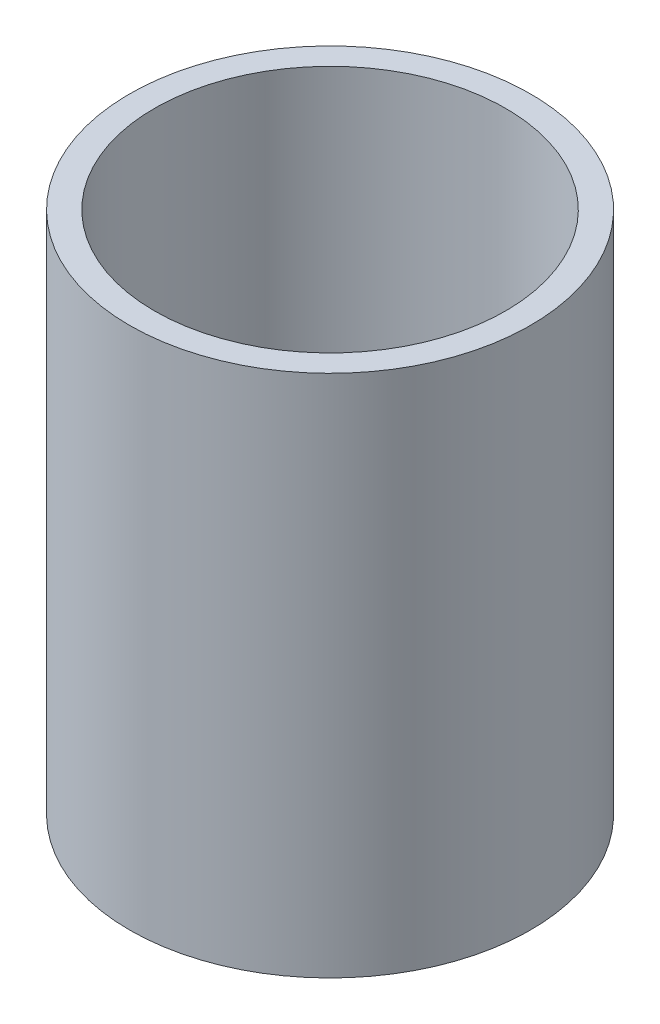
ISO-10303-21;
HEADER;
FILE_DESCRIPTION(('STEP AP214'),'2;1');
FILE_NAME('part.step','',(''),(''),'','','');
FILE_SCHEMA(('AUTOMOTIVE_DESIGN { 1 0 10303 214 1 1 1 1 }'));
ENDSEC;
DATA;
#1=APPLICATION_CONTEXT('core data for automotive mechanical design processes');
#2=APPLICATION_PROTOCOL_DEFINITION('international standard','automotive_design',2000,#1);
#3=PRODUCT_CONTEXT('',#1,'mechanical');
#4=PRODUCT('Part','Part','',(#3));
#5=PRODUCT_RELATED_PRODUCT_CATEGORY('part','',(#4));
#6=PRODUCT_DEFINITION_FORMATION('','',#4);
#7=PRODUCT_DEFINITION_CONTEXT('part definition',#1,'design');
#8=PRODUCT_DEFINITION('design','',#6,#7);
#9=PRODUCT_DEFINITION_SHAPE('','',#8);
#10=(LENGTH_UNIT() NAMED_UNIT(*) SI_UNIT(.MILLI.,.METRE.));
#11=(NAMED_UNIT(*) PLANE_ANGLE_UNIT() SI_UNIT($,.RADIAN.));
#12=(NAMED_UNIT(*) SI_UNIT($,.STERADIAN.) SOLID_ANGLE_UNIT());
#13=UNCERTAINTY_MEASURE_WITH_UNIT(LENGTH_MEASURE(1.E-05),#10,'distance_accuracy_value','');
#14=(GEOMETRIC_REPRESENTATION_CONTEXT(3) GLOBAL_UNCERTAINTY_ASSIGNED_CONTEXT((#13)) GLOBAL_UNIT_ASSIGNED_CONTEXT((#10,
#11,#12)) REPRESENTATION_CONTEXT('',''));
#15=CARTESIAN_POINT('',(0.,0.,0.));
#16=DIRECTION('',(0.,0.,1.));
#17=DIRECTION('',(1.,0.,0.));
#18=AXIS2_PLACEMENT_3D('',#15,#16,#17);
#19=CARTESIAN_POINT('',(0.,55.,0.));
#20=DIRECTION('',(0.,1.,0.));
#21=DIRECTION('',(0.,0.,1.));
#22=AXIS2_PLACEMENT_3D('',#19,#20,#21);
#23=CYLINDRICAL_SURFACE('',#22,51.054);
#24=CARTESIAN_POINT('',(0.,-87.732365567385,0.));
#25=DIRECTION('',(0.,1.,0.));
#26=DIRECTION('',(0.,0.,1.));
#27=AXIS2_PLACEMENT_3D('',#24,#25,#26);
#28=CIRCLE('',#27,51.054);
#29=CARTESIAN_POINT('',(0.,-87.732365567385,51.054));
#30=VERTEX_POINT('',#29);
#31=EDGE_CURVE('E10',#30,#30,#28,.T.);
#32=ORIENTED_EDGE('',*,*,#31,.T.);
#33=EDGE_LOOP('',(#32));
#34=FACE_BOUND('',#33,.T.);
#35=CARTESIAN_POINT('',(0.,45.6176344326149,0.));
#36=DIRECTION('',(0.,1.,0.));
#37=DIRECTION('',(0.,0.,1.));
#38=AXIS2_PLACEMENT_3D('',#35,#36,#37);
#39=CIRCLE('',#38,51.054);
#40=CARTESIAN_POINT('',(0.,45.6176344326149,51.054));
#41=VERTEX_POINT('',#40);
#42=EDGE_CURVE('E45',#41,#41,#39,.T.);
#43=ORIENTED_EDGE('',*,*,#42,.F.);
#44=EDGE_LOOP('',(#43));
#45=FACE_BOUND('',#44,.T.);
#46=ADVANCED_FACE('F31',(#34,#45),#23,.T.);
#47=CARTESIAN_POINT('',(-51.054,-87.7323655673851,0.));
#48=DIRECTION('',(0.,-1.,0.));
#49=DIRECTION('',(0.,0.,-1.));
#50=AXIS2_PLACEMENT_3D('',#47,#48,#49);
#51=PLANE('',#50);
#52=CARTESIAN_POINT('',(0.,-87.732365567385,0.));
#53=DIRECTION('',(0.,1.,0.));
#54=DIRECTION('',(0.,0.,1.));
#55=AXIS2_PLACEMENT_3D('',#52,#53,#54);
#56=CIRCLE('',#55,44.704);
#57=CARTESIAN_POINT('',(0.,-87.732365567385,44.704));
#58=VERTEX_POINT('',#57);
#59=EDGE_CURVE('E37',#58,#58,#56,.T.);
#60=ORIENTED_EDGE('',*,*,#59,.T.);
#61=EDGE_LOOP('',(#60));
#62=FACE_BOUND('',#61,.T.);
#63=ORIENTED_EDGE('',*,*,#31,.F.);
#64=EDGE_LOOP('',(#63));
#65=FACE_BOUND('',#64,.T.);
#66=ADVANCED_FACE('F55',(#62,#65),#51,.T.);
#67=CARTESIAN_POINT('',(0.,55.,0.));
#68=DIRECTION('',(0.,1.,0.));
#69=DIRECTION('',(0.,0.,1.));
#70=AXIS2_PLACEMENT_3D('',#67,#68,#69);
#71=CYLINDRICAL_SURFACE('',#70,44.704);
#72=CARTESIAN_POINT('',(0.,45.6176344326149,0.));
#73=DIRECTION('',(0.,1.,0.));
#74=DIRECTION('',(0.,0.,1.));
#75=AXIS2_PLACEMENT_3D('',#72,#73,#74);
#76=CIRCLE('',#75,44.704);
#77=CARTESIAN_POINT('',(0.,45.6176344326149,44.704));
#78=VERTEX_POINT('',#77);
#79=EDGE_CURVE('E41',#78,#78,#76,.T.);
#80=ORIENTED_EDGE('',*,*,#79,.T.);
#81=EDGE_LOOP('',(#80));
#82=FACE_BOUND('',#81,.T.);
#83=ORIENTED_EDGE('',*,*,#59,.F.);
#84=EDGE_LOOP('',(#83));
#85=FACE_BOUND('',#84,.T.);
#86=ADVANCED_FACE('F59',(#82,#85),#71,.F.);
#87=CARTESIAN_POINT('',(-51.054,45.6176344326149,0.));
#88=DIRECTION('',(0.,1.,0.));
#89=DIRECTION('',(0.,0.,1.));
#90=AXIS2_PLACEMENT_3D('',#87,#88,#89);
#91=PLANE('',#90);
#92=ORIENTED_EDGE('',*,*,#42,.T.);
#93=EDGE_LOOP('',(#92));
#94=FACE_BOUND('',#93,.T.);
#95=ORIENTED_EDGE('',*,*,#79,.F.);
#96=EDGE_LOOP('',(#95));
#97=FACE_BOUND('',#96,.T.);
#98=ADVANCED_FACE('F51',(#94,#97),#91,.T.);
#99=CLOSED_SHELL('',(#46,#66,#86,#98));
#100=MANIFOLD_SOLID_BREP('B2',#99);
#101=ADVANCED_BREP_SHAPE_REPRESENTATION('',(#18,#100),#14);
#102=SHAPE_DEFINITION_REPRESENTATION(#9,#101);
ENDSEC;
END-ISO-10303-21;
